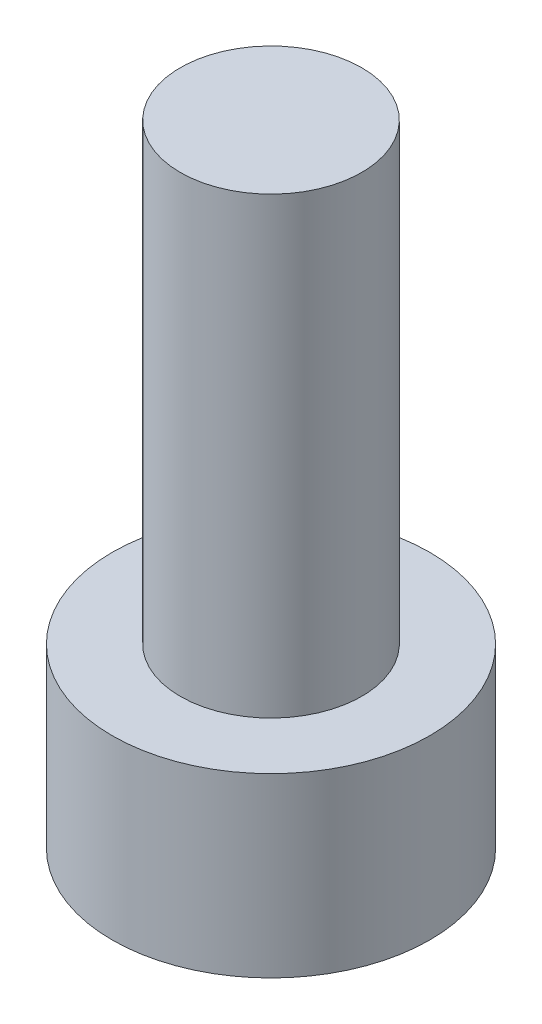
ISO-10303-21;
HEADER;
FILE_DESCRIPTION(('STEP AP214'),'2;1');
FILE_NAME('part.step','',(''),(''),'','','');
FILE_SCHEMA(('AUTOMOTIVE_DESIGN { 1 0 10303 214 1 1 1 1 }'));
ENDSEC;
DATA;
#1=APPLICATION_CONTEXT('core data for automotive mechanical design processes');
#2=APPLICATION_PROTOCOL_DEFINITION('international standard','automotive_design',2000,#1);
#3=PRODUCT_CONTEXT('',#1,'mechanical');
#4=PRODUCT('Part','Part','',(#3));
#5=PRODUCT_RELATED_PRODUCT_CATEGORY('part','',(#4));
#6=PRODUCT_DEFINITION_FORMATION('','',#4);
#7=PRODUCT_DEFINITION_CONTEXT('part definition',#1,'design');
#8=PRODUCT_DEFINITION('design','',#6,#7);
#9=PRODUCT_DEFINITION_SHAPE('','',#8);
#10=(LENGTH_UNIT() NAMED_UNIT(*) SI_UNIT(.MILLI.,.METRE.));
#11=(NAMED_UNIT(*) PLANE_ANGLE_UNIT() SI_UNIT($,.RADIAN.));
#12=(NAMED_UNIT(*) SI_UNIT($,.STERADIAN.) SOLID_ANGLE_UNIT());
#13=UNCERTAINTY_MEASURE_WITH_UNIT(LENGTH_MEASURE(1.E-05),#10,'distance_accuracy_value','');
#14=(GEOMETRIC_REPRESENTATION_CONTEXT(3) GLOBAL_UNCERTAINTY_ASSIGNED_CONTEXT((#13)) GLOBAL_UNIT_ASSIGNED_CONTEXT((#10,
#11,#12)) REPRESENTATION_CONTEXT('',''));
#15=CARTESIAN_POINT('',(0.,0.,0.));
#16=DIRECTION('',(0.,0.,1.));
#17=DIRECTION('',(1.,0.,0.));
#18=AXIS2_PLACEMENT_3D('',#15,#16,#17);
#19=CARTESIAN_POINT('',(0.,3.9,0.));
#20=DIRECTION('',(0.,-1.,0.));
#21=DIRECTION('',(0.,0.,-1.));
#22=AXIS2_PLACEMENT_3D('',#19,#20,#21);
#23=CYLINDRICAL_SURFACE('',#22,3.5);
#24=CARTESIAN_POINT('',(0.,3.9,0.));
#25=DIRECTION('',(0.,1.,0.));
#26=DIRECTION('',(0.,0.,1.));
#27=AXIS2_PLACEMENT_3D('',#24,#25,#26);
#28=CIRCLE('',#27,3.5);
#29=CARTESIAN_POINT('',(0.,3.9,3.5));
#30=VERTEX_POINT('',#29);
#31=EDGE_CURVE('E43',#30,#30,#28,.T.);
#32=ORIENTED_EDGE('',*,*,#31,.F.);
#33=EDGE_LOOP('',(#32));
#34=FACE_BOUND('',#33,.T.);
#35=CARTESIAN_POINT('',(0.,0.,0.));
#36=DIRECTION('',(0.,1.,0.));
#37=DIRECTION('',(0.,0.,1.));
#38=AXIS2_PLACEMENT_3D('',#35,#36,#37);
#39=CIRCLE('',#38,3.5);
#40=CARTESIAN_POINT('',(0.,0.,3.5));
#41=VERTEX_POINT('',#40);
#42=EDGE_CURVE('E38',#41,#41,#39,.T.);
#43=ORIENTED_EDGE('',*,*,#42,.T.);
#44=EDGE_LOOP('',(#43));
#45=FACE_BOUND('',#44,.T.);
#46=ADVANCED_FACE('F35',(#34,#45),#23,.T.);
#47=CARTESIAN_POINT('',(0.,3.9,0.));
#48=DIRECTION('',(0.,1.,0.));
#49=DIRECTION('',(0.,0.,1.));
#50=AXIS2_PLACEMENT_3D('',#47,#48,#49);
#51=PLANE('',#50);
#52=CARTESIAN_POINT('',(0.,3.9,0.));
#53=DIRECTION('',(0.,1.,0.));
#54=DIRECTION('',(0.,0.,1.));
#55=AXIS2_PLACEMENT_3D('',#52,#53,#54);
#56=CIRCLE('',#55,2.);
#57=CARTESIAN_POINT('',(0.,3.9,2.));
#58=VERTEX_POINT('',#57);
#59=EDGE_CURVE('E11',#58,#58,#56,.T.);
#60=ORIENTED_EDGE('',*,*,#59,.F.);
#61=EDGE_LOOP('',(#60));
#62=FACE_BOUND('',#61,.T.);
#63=ORIENTED_EDGE('',*,*,#31,.T.);
#64=EDGE_LOOP('',(#63));
#65=FACE_BOUND('',#64,.T.);
#66=ADVANCED_FACE('F155',(#62,#65),#51,.T.);
#67=CARTESIAN_POINT('',(0.,0.,0.));
#68=DIRECTION('',(0.,1.,0.));
#69=DIRECTION('',(0.,0.,1.));
#70=AXIS2_PLACEMENT_3D('',#67,#68,#69);
#71=PLANE('',#70);
#72=DIRECTION('',(-0.5,0.,0.866025403784438));
#73=VECTOR('',#72,1.);
#74=CARTESIAN_POINT('',(1.725,0.,0.));
#75=LINE('',#74,#73);
#76=CARTESIAN_POINT('',(1.725,0.,0.));
#77=VERTEX_POINT('',#76);
#78=CARTESIAN_POINT('',(0.862499999999999,0.,1.49389382152816));
#79=VERTEX_POINT('',#78);
#80=EDGE_CURVE('E125',#77,#79,#75,.T.);
#81=ORIENTED_EDGE('',*,*,#80,.F.);
#82=DIRECTION('',(0.5,0.,0.866025403784439));
#83=VECTOR('',#82,1.);
#84=CARTESIAN_POINT('',(0.8625,0.,-1.49389382152816));
#85=LINE('',#84,#83);
#86=CARTESIAN_POINT('',(0.8625,0.,-1.49389382152816));
#87=VERTEX_POINT('',#86);
#88=EDGE_CURVE('E51',#87,#77,#85,.T.);
#89=ORIENTED_EDGE('',*,*,#88,.F.);
#90=DIRECTION('',(1.,0.,0.));
#91=VECTOR('',#90,1.);
#92=CARTESIAN_POINT('',(-0.8625,0.,-1.49389382152816));
#93=LINE('',#92,#91);
#94=CARTESIAN_POINT('',(-0.8625,0.,-1.49389382152816));
#95=VERTEX_POINT('',#94);
#96=EDGE_CURVE('E134',#95,#87,#93,.T.);
#97=ORIENTED_EDGE('',*,*,#96,.F.);
#98=DIRECTION('',(0.5,0.,-0.866025403784439));
#99=VECTOR('',#98,1.);
#100=CARTESIAN_POINT('',(-1.725,0.,0.));
#101=LINE('',#100,#99);
#102=CARTESIAN_POINT('',(-1.725,0.,0.));
#103=VERTEX_POINT('',#102);
#104=EDGE_CURVE('E132',#103,#95,#101,.T.);
#105=ORIENTED_EDGE('',*,*,#104,.F.);
#106=DIRECTION('',(-0.5,0.,-0.866025403784439));
#107=VECTOR('',#106,1.);
#108=CARTESIAN_POINT('',(-0.8625,0.,1.49389382152816));
#109=LINE('',#108,#107);
#110=CARTESIAN_POINT('',(-0.8625,0.,1.49389382152816));
#111=VERTEX_POINT('',#110);
#112=EDGE_CURVE('E99',#111,#103,#109,.T.);
#113=ORIENTED_EDGE('',*,*,#112,.F.);
#114=DIRECTION('',(-1.,0.,0.));
#115=VECTOR('',#114,1.);
#116=CARTESIAN_POINT('',(0.862499999999999,0.,1.49389382152816));
#117=LINE('',#116,#115);
#118=EDGE_CURVE('E128',#79,#111,#117,.T.);
#119=ORIENTED_EDGE('',*,*,#118,.F.);
#120=EDGE_LOOP('',(#81,#89,#97,#105,#113,#119));
#121=FACE_BOUND('',#120,.T.);
#122=ORIENTED_EDGE('',*,*,#42,.F.);
#123=EDGE_LOOP('',(#122));
#124=FACE_BOUND('',#123,.T.);
#125=ADVANCED_FACE('F152',(#121,#124),#71,.F.);
#126=CARTESIAN_POINT('',(0.,13.9,0.));
#127=DIRECTION('',(0.,-1.,0.));
#128=DIRECTION('',(0.,0.,-1.));
#129=AXIS2_PLACEMENT_3D('',#126,#127,#128);
#130=CYLINDRICAL_SURFACE('',#129,2.);
#131=CARTESIAN_POINT('',(0.,13.9,0.));
#132=DIRECTION('',(0.,1.,0.));
#133=DIRECTION('',(0.,0.,1.));
#134=AXIS2_PLACEMENT_3D('',#131,#132,#133);
#135=CIRCLE('',#134,2.);
#136=CARTESIAN_POINT('',(0.,13.9,2.));
#137=VERTEX_POINT('',#136);
#138=EDGE_CURVE('E138',#137,#137,#135,.T.);
#139=ORIENTED_EDGE('',*,*,#138,.F.);
#140=EDGE_LOOP('',(#139));
#141=FACE_BOUND('',#140,.T.);
#142=ORIENTED_EDGE('',*,*,#59,.T.);
#143=EDGE_LOOP('',(#142));
#144=FACE_BOUND('',#143,.T.);
#145=ADVANCED_FACE('F154',(#141,#144),#130,.T.);
#146=CARTESIAN_POINT('',(0.,13.9,0.));
#147=DIRECTION('',(0.,1.,0.));
#148=DIRECTION('',(0.,0.,1.));
#149=AXIS2_PLACEMENT_3D('',#146,#147,#148);
#150=PLANE('',#149);
#151=ORIENTED_EDGE('',*,*,#138,.T.);
#152=EDGE_LOOP('',(#151));
#153=FACE_BOUND('',#152,.T.);
#154=ADVANCED_FACE('F161',(#153),#150,.T.);
#155=CARTESIAN_POINT('',(0.8625,2.4,-1.49389382152816));
#156=DIRECTION('',(0.866025403784439,0.,-0.5));
#157=DIRECTION('',(-0.5,0.,-0.866025403784439));
#158=AXIS2_PLACEMENT_3D('',#155,#156,#157);
#159=PLANE('',#158);
#160=ORIENTED_EDGE('',*,*,#88,.T.);
#161=DIRECTION('',(0.,-1.,0.));
#162=VECTOR('',#161,1.);
#163=CARTESIAN_POINT('',(1.725,2.4,0.));
#164=LINE('',#163,#162);
#165=CARTESIAN_POINT('',(1.725,2.4,0.));
#166=VERTEX_POINT('',#165);
#167=EDGE_CURVE('E81',#166,#77,#164,.T.);
#168=ORIENTED_EDGE('',*,*,#167,.F.);
#169=DIRECTION('',(0.5,0.,0.866025403784439));
#170=VECTOR('',#169,1.);
#171=CARTESIAN_POINT('',(0.8625,2.4,-1.49389382152816));
#172=LINE('',#171,#170);
#173=CARTESIAN_POINT('',(0.8625,2.4,-1.49389382152816));
#174=VERTEX_POINT('',#173);
#175=EDGE_CURVE('E136',#174,#166,#172,.T.);
#176=ORIENTED_EDGE('',*,*,#175,.F.);
#177=DIRECTION('',(0.,-1.,0.));
#178=VECTOR('',#177,1.);
#179=CARTESIAN_POINT('',(0.8625,2.4,-1.49389382152816));
#180=LINE('',#179,#178);
#181=EDGE_CURVE('E59',#174,#87,#180,.T.);
#182=ORIENTED_EDGE('',*,*,#181,.T.);
#183=EDGE_LOOP('',(#160,#168,#176,#182));
#184=FACE_BOUND('',#183,.T.);
#185=ADVANCED_FACE('F190',(#184),#159,.F.);
#186=CARTESIAN_POINT('',(-0.8625,2.4,-1.49389382152816));
#187=DIRECTION('',(0.,0.,-1.));
#188=DIRECTION('',(-1.,0.,0.));
#189=AXIS2_PLACEMENT_3D('',#186,#187,#188);
#190=PLANE('',#189);
#191=ORIENTED_EDGE('',*,*,#96,.T.);
#192=ORIENTED_EDGE('',*,*,#181,.F.);
#193=DIRECTION('',(1.,0.,0.));
#194=VECTOR('',#193,1.);
#195=CARTESIAN_POINT('',(-0.8625,2.4,-1.49389382152816));
#196=LINE('',#195,#194);
#197=CARTESIAN_POINT('',(-0.8625,2.4,-1.49389382152816));
#198=VERTEX_POINT('',#197);
#199=EDGE_CURVE('E111',#198,#174,#196,.T.);
#200=ORIENTED_EDGE('',*,*,#199,.F.);
#201=DIRECTION('',(0.,-1.,0.));
#202=VECTOR('',#201,1.);
#203=CARTESIAN_POINT('',(-0.8625,2.4,-1.49389382152816));
#204=LINE('',#203,#202);
#205=EDGE_CURVE('E103',#198,#95,#204,.T.);
#206=ORIENTED_EDGE('',*,*,#205,.T.);
#207=EDGE_LOOP('',(#191,#192,#200,#206));
#208=FACE_BOUND('',#207,.T.);
#209=ADVANCED_FACE('F204',(#208),#190,.F.);
#210=CARTESIAN_POINT('',(-1.725,2.4,0.));
#211=DIRECTION('',(-0.866025403784439,0.,-0.5));
#212=DIRECTION('',(-0.5,0.,0.866025403784439));
#213=AXIS2_PLACEMENT_3D('',#210,#211,#212);
#214=PLANE('',#213);
#215=ORIENTED_EDGE('',*,*,#104,.T.);
#216=ORIENTED_EDGE('',*,*,#205,.F.);
#217=DIRECTION('',(0.5,0.,-0.866025403784439));
#218=VECTOR('',#217,1.);
#219=CARTESIAN_POINT('',(-1.725,2.4,0.));
#220=LINE('',#219,#218);
#221=CARTESIAN_POINT('',(-1.725,2.4,0.));
#222=VERTEX_POINT('',#221);
#223=EDGE_CURVE('E107',#222,#198,#220,.T.);
#224=ORIENTED_EDGE('',*,*,#223,.F.);
#225=DIRECTION('',(0.,-1.,0.));
#226=VECTOR('',#225,1.);
#227=CARTESIAN_POINT('',(-1.725,2.4,0.));
#228=LINE('',#227,#226);
#229=EDGE_CURVE('E92',#222,#103,#228,.T.);
#230=ORIENTED_EDGE('',*,*,#229,.T.);
#231=EDGE_LOOP('',(#215,#216,#224,#230));
#232=FACE_BOUND('',#231,.T.);
#233=ADVANCED_FACE('F108',(#232),#214,.F.);
#234=CARTESIAN_POINT('',(-0.8625,2.4,1.49389382152816));
#235=DIRECTION('',(-0.866025403784439,0.,0.5));
#236=DIRECTION('',(0.5,0.,0.866025403784439));
#237=AXIS2_PLACEMENT_3D('',#234,#235,#236);
#238=PLANE('',#237);
#239=ORIENTED_EDGE('',*,*,#112,.T.);
#240=ORIENTED_EDGE('',*,*,#229,.F.);
#241=DIRECTION('',(-0.5,0.,-0.866025403784439));
#242=VECTOR('',#241,1.);
#243=CARTESIAN_POINT('',(-0.8625,2.4,1.49389382152816));
#244=LINE('',#243,#242);
#245=CARTESIAN_POINT('',(-0.8625,2.4,1.49389382152816));
#246=VERTEX_POINT('',#245);
#247=EDGE_CURVE('E96',#246,#222,#244,.T.);
#248=ORIENTED_EDGE('',*,*,#247,.F.);
#249=DIRECTION('',(0.,-1.,0.));
#250=VECTOR('',#249,1.);
#251=CARTESIAN_POINT('',(-0.8625,2.4,1.49389382152816));
#252=LINE('',#251,#250);
#253=EDGE_CURVE('E104',#246,#111,#252,.T.);
#254=ORIENTED_EDGE('',*,*,#253,.T.);
#255=EDGE_LOOP('',(#239,#240,#248,#254));
#256=FACE_BOUND('',#255,.T.);
#257=ADVANCED_FACE('F94',(#256),#238,.F.);
#258=CARTESIAN_POINT('',(0.862499999999999,2.4,1.49389382152816));
#259=DIRECTION('',(0.,0.,1.));
#260=DIRECTION('',(1.,0.,0.));
#261=AXIS2_PLACEMENT_3D('',#258,#259,#260);
#262=PLANE('',#261);
#263=ORIENTED_EDGE('',*,*,#118,.T.);
#264=ORIENTED_EDGE('',*,*,#253,.F.);
#265=DIRECTION('',(-1.,0.,0.));
#266=VECTOR('',#265,1.);
#267=CARTESIAN_POINT('',(0.862499999999999,2.4,1.49389382152816));
#268=LINE('',#267,#266);
#269=CARTESIAN_POINT('',(0.862499999999999,2.4,1.49389382152816));
#270=VERTEX_POINT('',#269);
#271=EDGE_CURVE('E117',#270,#246,#268,.T.);
#272=ORIENTED_EDGE('',*,*,#271,.F.);
#273=DIRECTION('',(0.,-1.,0.));
#274=VECTOR('',#273,1.);
#275=CARTESIAN_POINT('',(0.862499999999999,2.4,1.49389382152816));
#276=LINE('',#275,#274);
#277=EDGE_CURVE('E141',#270,#79,#276,.T.);
#278=ORIENTED_EDGE('',*,*,#277,.T.);
#279=EDGE_LOOP('',(#263,#264,#272,#278));
#280=FACE_BOUND('',#279,.T.);
#281=ADVANCED_FACE('F229',(#280),#262,.F.);
#282=CARTESIAN_POINT('',(1.725,2.4,0.));
#283=DIRECTION('',(0.866025403784439,0.,0.5));
#284=DIRECTION('',(0.5,0.,-0.866025403784439));
#285=AXIS2_PLACEMENT_3D('',#282,#283,#284);
#286=PLANE('',#285);
#287=ORIENTED_EDGE('',*,*,#80,.T.);
#288=ORIENTED_EDGE('',*,*,#277,.F.);
#289=DIRECTION('',(-0.5,0.,0.866025403784438));
#290=VECTOR('',#289,1.);
#291=CARTESIAN_POINT('',(1.725,2.4,0.));
#292=LINE('',#291,#290);
#293=EDGE_CURVE('E119',#166,#270,#292,.T.);
#294=ORIENTED_EDGE('',*,*,#293,.F.);
#295=ORIENTED_EDGE('',*,*,#167,.T.);
#296=EDGE_LOOP('',(#287,#288,#294,#295));
#297=FACE_BOUND('',#296,.T.);
#298=ADVANCED_FACE('F238',(#297),#286,.F.);
#299=CARTESIAN_POINT('',(0.,2.4,0.));
#300=DIRECTION('',(0.,-1.,0.));
#301=DIRECTION('',(0.,0.,-1.));
#302=AXIS2_PLACEMENT_3D('',#299,#300,#301);
#303=PLANE('',#302);
#304=ORIENTED_EDGE('',*,*,#175,.T.);
#305=ORIENTED_EDGE('',*,*,#293,.T.);
#306=ORIENTED_EDGE('',*,*,#271,.T.);
#307=ORIENTED_EDGE('',*,*,#247,.T.);
#308=ORIENTED_EDGE('',*,*,#223,.T.);
#309=ORIENTED_EDGE('',*,*,#199,.T.);
#310=EDGE_LOOP('',(#304,#305,#306,#307,#308,#309));
#311=FACE_BOUND('',#310,.T.);
#312=ADVANCED_FACE('F114',(#311),#303,.T.);
#313=CLOSED_SHELL('',(#46,#66,#125,#145,#154,#185,#209,#233,#257,#281,#298,#312));
#314=MANIFOLD_SOLID_BREP('B2',#313);
#315=ADVANCED_BREP_SHAPE_REPRESENTATION('',(#18,#314),#14);
#316=SHAPE_DEFINITION_REPRESENTATION(#9,#315);
ENDSEC;
END-ISO-10303-21;
